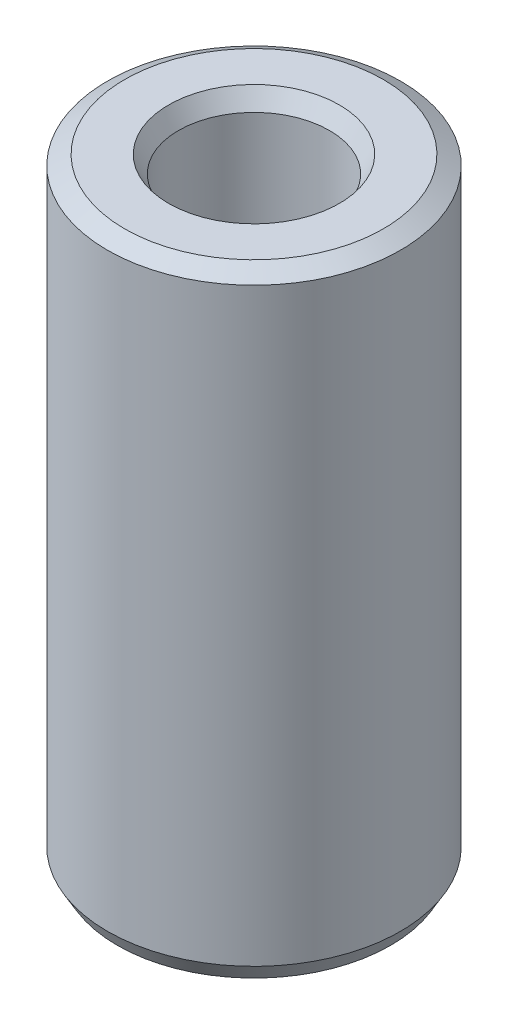
ISO-10303-21;
HEADER;
FILE_DESCRIPTION(('STEP AP214'),'2;1');
FILE_NAME('part.step','',(''),(''),'','','');
FILE_SCHEMA(('AUTOMOTIVE_DESIGN { 1 0 10303 214 1 1 1 1 }'));
ENDSEC;
DATA;
#1=APPLICATION_CONTEXT('core data for automotive mechanical design processes');
#2=APPLICATION_PROTOCOL_DEFINITION('international standard','automotive_design',2000,#1);
#3=PRODUCT_CONTEXT('',#1,'mechanical');
#4=PRODUCT('Part','Part','',(#3));
#5=PRODUCT_RELATED_PRODUCT_CATEGORY('part','',(#4));
#6=PRODUCT_DEFINITION_FORMATION('','',#4);
#7=PRODUCT_DEFINITION_CONTEXT('part definition',#1,'design');
#8=PRODUCT_DEFINITION('design','',#6,#7);
#9=PRODUCT_DEFINITION_SHAPE('','',#8);
#10=(LENGTH_UNIT() NAMED_UNIT(*) SI_UNIT(.MILLI.,.METRE.));
#11=(NAMED_UNIT(*) PLANE_ANGLE_UNIT() SI_UNIT($,.RADIAN.));
#12=(NAMED_UNIT(*) SI_UNIT($,.STERADIAN.) SOLID_ANGLE_UNIT());
#13=UNCERTAINTY_MEASURE_WITH_UNIT(LENGTH_MEASURE(1.E-05),#10,'distance_accuracy_value','');
#14=(GEOMETRIC_REPRESENTATION_CONTEXT(3) GLOBAL_UNCERTAINTY_ASSIGNED_CONTEXT((#13)) GLOBAL_UNIT_ASSIGNED_CONTEXT((#10,
#11,#12)) REPRESENTATION_CONTEXT('',''));
#15=CARTESIAN_POINT('',(0.,0.,0.));
#16=DIRECTION('',(0.,0.,1.));
#17=DIRECTION('',(1.,0.,0.));
#18=AXIS2_PLACEMENT_3D('',#15,#16,#17);
#19=CARTESIAN_POINT('',(0.,221.029050381448,0.));
#20=DIRECTION('',(0.,-1.,0.));
#21=DIRECTION('',(0.,0.,-1.));
#22=AXIS2_PLACEMENT_3D('',#19,#20,#21);
#23=CYLINDRICAL_SURFACE('',#22,52.5);
#24=CARTESIAN_POINT('',(0.,6.15118826672589,0.));
#25=DIRECTION('',(0.,1.,0.));
#26=DIRECTION('',(0.,0.,1.));
#27=AXIS2_PLACEMENT_3D('',#24,#25,#26);
#28=CIRCLE('',#27,52.5);
#29=CARTESIAN_POINT('',(0.,6.15118826672589,52.5));
#30=VERTEX_POINT('',#29);
#31=EDGE_CURVE('E10',#30,#30,#28,.T.);
#32=ORIENTED_EDGE('',*,*,#31,.T.);
#33=EDGE_LOOP('',(#32));
#34=FACE_BOUND('',#33,.T.);
#35=CARTESIAN_POINT('',(0.,217.477660179818,0.));
#36=DIRECTION('',(0.,1.,0.));
#37=DIRECTION('',(0.,0.,1.));
#38=AXIS2_PLACEMENT_3D('',#35,#36,#37);
#39=CIRCLE('',#38,52.5);
#40=CARTESIAN_POINT('',(0.,217.477660179818,52.5));
#41=VERTEX_POINT('',#40);
#42=EDGE_CURVE('E50',#41,#41,#39,.F.);
#43=ORIENTED_EDGE('',*,*,#42,.T.);
#44=EDGE_LOOP('',(#43));
#45=FACE_BOUND('',#44,.T.);
#46=ADVANCED_FACE('F39',(#34,#45),#23,.T.);
#47=CARTESIAN_POINT('',(0.,221.029050381448,0.));
#48=DIRECTION('',(0.,1.,0.));
#49=DIRECTION('',(0.,0.,1.));
#50=AXIS2_PLACEMENT_3D('',#47,#48,#49);
#51=PLANE('',#50);
#52=CARTESIAN_POINT('',(0.,221.029050381448,0.));
#53=DIRECTION('',(0.,1.,0.));
#54=DIRECTION('',(0.,0.,1.));
#55=AXIS2_PLACEMENT_3D('',#52,#53,#54);
#56=CIRCLE('',#55,30.5888498017471);
#57=CARTESIAN_POINT('',(0.,221.029050381448,30.5888498017471));
#58=VERTEX_POINT('',#57);
#59=EDGE_CURVE('E58',#58,#58,#56,.F.);
#60=ORIENTED_EDGE('',*,*,#59,.T.);
#61=EDGE_LOOP('',(#60));
#62=FACE_BOUND('',#61,.T.);
#63=CARTESIAN_POINT('',(0.,221.029050381448,0.));
#64=DIRECTION('',(0.,1.,0.));
#65=DIRECTION('',(0.,0.,1.));
#66=AXIS2_PLACEMENT_3D('',#63,#64,#65);
#67=CIRCLE('',#66,46.3488117332742);
#68=CARTESIAN_POINT('',(0.,221.029050381448,46.3488117332742));
#69=VERTEX_POINT('',#68);
#70=EDGE_CURVE('E61',#69,#69,#67,.T.);
#71=ORIENTED_EDGE('',*,*,#70,.T.);
#72=EDGE_LOOP('',(#71));
#73=FACE_BOUND('',#72,.T.);
#74=ADVANCED_FACE('F88',(#62,#73),#51,.T.);
#75=CARTESIAN_POINT('',(0.,0.,0.));
#76=DIRECTION('',(0.,1.,0.));
#77=DIRECTION('',(0.,0.,1.));
#78=AXIS2_PLACEMENT_3D('',#75,#76,#77);
#79=PLANE('',#78);
#80=CARTESIAN_POINT('',(0.,0.,0.));
#81=DIRECTION('',(0.,1.,0.));
#82=DIRECTION('',(0.,0.,1.));
#83=AXIS2_PLACEMENT_3D('',#80,#81,#82);
#84=CIRCLE('',#83,33.1886478668428);
#85=CARTESIAN_POINT('',(0.,0.,-33.1886478668428));
#86=VERTEX_POINT('',#85);
#87=EDGE_CURVE('E51',#86,#86,#84,.T.);
#88=ORIENTED_EDGE('',*,*,#87,.T.);
#89=EDGE_LOOP('',(#88));
#90=FACE_BOUND('',#89,.T.);
#91=CARTESIAN_POINT('',(0.,0.,0.));
#92=DIRECTION('',(0.,1.,0.));
#93=DIRECTION('',(0.,0.,1.));
#94=AXIS2_PLACEMENT_3D('',#91,#92,#93);
#95=CIRCLE('',#94,48.9486097983697);
#96=CARTESIAN_POINT('',(0.,0.,48.9486097983697));
#97=VERTEX_POINT('',#96);
#98=EDGE_CURVE('E54',#97,#97,#95,.F.);
#99=ORIENTED_EDGE('',*,*,#98,.T.);
#100=EDGE_LOOP('',(#99));
#101=FACE_BOUND('',#100,.T.);
#102=ADVANCED_FACE('F83',(#90,#101),#79,.F.);
#103=CARTESIAN_POINT('',(0.,221.029050381448,0.));
#104=DIRECTION('',(0.,-1.,0.));
#105=DIRECTION('',(0.,0.,-1.));
#106=AXIS2_PLACEMENT_3D('',#103,#104,#105);
#107=CYLINDRICAL_SURFACE('',#106,27.037459600117);
#108=CARTESIAN_POINT('',(0.,214.877862114723,0.));
#109=DIRECTION('',(0.,1.,0.));
#110=DIRECTION('',(0.,0.,1.));
#111=AXIS2_PLACEMENT_3D('',#108,#109,#110);
#112=CIRCLE('',#111,27.037459600117);
#113=CARTESIAN_POINT('',(0.,214.877862114723,27.037459600117));
#114=VERTEX_POINT('',#113);
#115=EDGE_CURVE('E67',#114,#114,#112,.T.);
#116=ORIENTED_EDGE('',*,*,#115,.T.);
#117=EDGE_LOOP('',(#116));
#118=FACE_BOUND('',#117,.T.);
#119=CARTESIAN_POINT('',(0.,3.55139020163028,0.));
#120=DIRECTION('',(0.,1.,0.));
#121=DIRECTION('',(0.,0.,1.));
#122=AXIS2_PLACEMENT_3D('',#119,#120,#121);
#123=CIRCLE('',#122,27.037459600117);
#124=CARTESIAN_POINT('',(0.,3.55139020163028,-27.037459600117));
#125=VERTEX_POINT('',#124);
#126=EDGE_CURVE('E69',#125,#125,#123,.F.);
#127=ORIENTED_EDGE('',*,*,#126,.T.);
#128=EDGE_LOOP('',(#127));
#129=FACE_BOUND('',#128,.T.);
#130=ADVANCED_FACE('F71',(#118,#129),#107,.F.);
#131=CARTESIAN_POINT('',(0.,214.877862114723,0.));
#132=DIRECTION('',(0.,1.,0.));
#133=DIRECTION('',(0.,0.,1.));
#134=AXIS2_PLACEMENT_3D('',#131,#132,#133);
#135=CONICAL_SURFACE('',#134,27.037459600117,0.523598775598298);
#136=ORIENTED_EDGE('',*,*,#59,.F.);
#137=EDGE_LOOP('',(#136));
#138=FACE_BOUND('',#137,.T.);
#139=ORIENTED_EDGE('',*,*,#115,.F.);
#140=EDGE_LOOP('',(#139));
#141=FACE_BOUND('',#140,.T.);
#142=ADVANCED_FACE('F77',(#138,#141),#135,.F.);
#143=CARTESIAN_POINT('',(0.,0.,0.));
#144=DIRECTION('',(0.,-1.,0.));
#145=DIRECTION('',(0.,0.,-1.));
#146=AXIS2_PLACEMENT_3D('',#143,#144,#145);
#147=CONICAL_SURFACE('',#146,33.1886478668428,1.04719755119659);
#148=CARTESIAN_POINT('',(0.,3.55139020163028,-27.037459600117));
#149=CARTESIAN_POINT('',(0.,3.51439655369663,-27.1015344778954));
#150=CARTESIAN_POINT('',(0.,3.47740290576299,-27.1656093556738));
#151=CARTESIAN_POINT('',(0.,3.40341560989569,-27.2937591112305));
#152=CARTESIAN_POINT('',(0.,3.36642196196204,-27.3578339890089));
#153=CARTESIAN_POINT('',(0.,3.29243466609474,-27.4859837445657));
#154=CARTESIAN_POINT('',(0.,3.25544101816109,-27.5500586223441));
#155=CARTESIAN_POINT('',(0.,3.18145372229379,-27.6782083779009));
#156=CARTESIAN_POINT('',(0.,3.14446007436015,-27.7422832556793));
#157=CARTESIAN_POINT('',(0.,3.07047277849285,-27.8704330112361));
#158=CARTESIAN_POINT('',(0.,3.0334791305592,-27.9345078890145));
#159=CARTESIAN_POINT('',(0.,2.9594918346919,-28.0626576445713));
#160=CARTESIAN_POINT('',(0.,2.92249818675825,-28.1267325223497));
#161=CARTESIAN_POINT('',(0.,2.84851089089096,-28.2548822779065));
#162=CARTESIAN_POINT('',(0.,2.81151724295731,-28.3189571556849));
#163=CARTESIAN_POINT('',(0.,2.73752994709001,-28.4471069112416));
#164=CARTESIAN_POINT('',(0.,2.70053629915636,-28.51118178902));
#165=CARTESIAN_POINT('',(0.,2.62654900328906,-28.6393315445768));
#166=CARTESIAN_POINT('',(0.,2.58955535535541,-28.7034064223552));
#167=CARTESIAN_POINT('',(0.,2.51556805948812,-28.831556177912));
#168=CARTESIAN_POINT('',(0.,2.47857441155447,-28.8956310556904));
#169=CARTESIAN_POINT('',(0.,2.40458711568717,-29.0237808112472));
#170=CARTESIAN_POINT('',(0.,2.36759346775352,-29.0878556890256));
#171=CARTESIAN_POINT('',(0.,2.29360617188622,-29.2160054445824));
#172=CARTESIAN_POINT('',(0.,2.25661252395258,-29.2800803223608));
#173=CARTESIAN_POINT('',(0.,2.18262522808528,-29.4082300779176));
#174=CARTESIAN_POINT('',(0.,2.14563158015163,-29.472304955696));
#175=CARTESIAN_POINT('',(0.,2.07164428428433,-29.6004547112527));
#176=CARTESIAN_POINT('',(0.,2.03465063635068,-29.6645295890311));
#177=CARTESIAN_POINT('',(0.,1.96066334048339,-29.7926793445879));
#178=CARTESIAN_POINT('',(0.,1.92366969254974,-29.8567542223663));
#179=CARTESIAN_POINT('',(0.,1.84968239668244,-29.9849039779231));
#180=CARTESIAN_POINT('',(0.,1.81268874874879,-30.0489788557015));
#181=CARTESIAN_POINT('',(0.,1.73870145288149,-30.1771286112583));
#182=CARTESIAN_POINT('',(0.,1.70170780494784,-30.2412034890367));
#183=CARTESIAN_POINT('',(0.,1.62772050908055,-30.3693532445935));
#184=CARTESIAN_POINT('',(0.,1.5907268611469,-30.4334281223719));
#185=CARTESIAN_POINT('',(0.,1.5167395652796,-30.5615778779287));
#186=CARTESIAN_POINT('',(0.,1.47974591734595,-30.6256527557071));
#187=CARTESIAN_POINT('',(0.,1.40575862147865,-30.7538025112638));
#188=CARTESIAN_POINT('',(0.,1.36876497354501,-30.8178773890422));
#189=CARTESIAN_POINT('',(0.,1.29477767767771,-30.946027144599));
#190=CARTESIAN_POINT('',(0.,1.25778402974406,-31.0101020223774));
#191=CARTESIAN_POINT('',(0.,1.18379673387676,-31.1382517779342));
#192=CARTESIAN_POINT('',(0.,1.14680308594311,-31.2023266557126));
#193=CARTESIAN_POINT('',(0.,1.07281579007581,-31.3304764112694));
#194=CARTESIAN_POINT('',(0.,1.03582214214217,-31.3945512890478));
#195=CARTESIAN_POINT('',(0.,0.961834846274868,-31.5227010446046));
#196=CARTESIAN_POINT('',(0.,0.92484119834122,-31.586775922383));
#197=CARTESIAN_POINT('',(0.,0.850853902473922,-31.7149256779398));
#198=CARTESIAN_POINT('',(0.,0.813860254540273,-31.7790005557182));
#199=CARTESIAN_POINT('',(0.,0.739872958672975,-31.9071503112749));
#200=CARTESIAN_POINT('',(0.,0.702879310739327,-31.9712251890533));
#201=CARTESIAN_POINT('',(0.,0.62889201487203,-32.0993749446101));
#202=CARTESIAN_POINT('',(0.,0.591898366938381,-32.1634498223885));
#203=CARTESIAN_POINT('',(0.,0.517911071071082,-32.2915995779453));
#204=CARTESIAN_POINT('',(0.,0.480917423137433,-32.3556744557237));
#205=CARTESIAN_POINT('',(0.,0.406930127270136,-32.4838242112805));
#206=CARTESIAN_POINT('',(0.,0.369936479336488,-32.5478990890589));
#207=CARTESIAN_POINT('',(0.,0.295949183469191,-32.6760488446157));
#208=CARTESIAN_POINT('',(0.,0.258955535535541,-32.7401237223941));
#209=CARTESIAN_POINT('',(0.,0.184968239668243,-32.8682734779509));
#210=CARTESIAN_POINT('',(0.,0.147974591734595,-32.9323483557293));
#211=CARTESIAN_POINT('',(0.,0.0739872958672987,-33.0604981112861));
#212=CARTESIAN_POINT('',(0.,0.0369936479336505,-33.1245729890644));
#213=CARTESIAN_POINT('',(0.,0.,-33.1886478668428));
#214=B_SPLINE_CURVE_WITH_KNOTS('',3,(#148,#149,#150,#151,#152,#153,#154,#155,#156,#157,#158,
#159,#160,#161,#162,#163,#164,#165,#166,#167,#168,#169,#170,#171,#172,#173,#174,#175,#176,#177,
#178,#179,#180,#181,#182,#183,#184,#185,#186,#187,#188,#189,#190,#191,#192,#193,#194,#195,#196,
#197,#198,#199,#200,#201,#202,#203,#204,#205,#206,#207,#208,#209,#210,#211,#212,#213),
.UNSPECIFIED.,.F.,.F.,(4,2,2,2,2,2,2,2,2,2,2,2,2,2,2,2,2,2,2,2,2,2,2,2,2,2,2,2,2,2,2,2,4),(0.,
0.221961887601892,0.44392377520378,0.665885662805672,0.887847550407564,1.10980943800946,
1.33177132561135,1.55373321321324,1.77569510081513,1.99765698841702,2.21961887601891,
2.4415807636208,2.66354265122269,2.88550453882458,3.10746642642648,3.32942831402837,
3.55139020163026,3.77335208923215,3.99531397683404,4.21727586443593,4.43923775203782,
4.66119963963971,4.8831615272416,5.10512341484349,5.32708530244539,5.54904719004727,
5.77100907764917,5.99297096525106,6.21493285285295,6.43689474045484,6.65885662805673,
6.88081851565862,7.10278040326051),.UNSPECIFIED.);
#215=EDGE_CURVE('BSEAM73',#125,#86,#214,.T.);
#216=ORIENTED_EDGE('',*,*,#126,.F.);
#217=ORIENTED_EDGE('',*,*,#87,.F.);
#218=ORIENTED_EDGE('',*,*,#215,.T.);
#219=ORIENTED_EDGE('',*,*,#215,.F.);
#220=EDGE_LOOP('',(#216,#218,#217,#219));
#221=FACE_BOUND('',#220,.T.);
#222=ADVANCED_FACE('F73',(#221),#147,.F.);
#223=CARTESIAN_POINT('',(0.,6.15118826672589,0.));
#224=DIRECTION('',(0.,1.,0.));
#225=DIRECTION('',(0.,0.,1.));
#226=AXIS2_PLACEMENT_3D('',#223,#224,#225);
#227=CONICAL_SURFACE('',#226,52.5,0.523598775598301);
#228=ORIENTED_EDGE('',*,*,#98,.F.);
#229=EDGE_LOOP('',(#228));
#230=FACE_BOUND('',#229,.T.);
#231=ORIENTED_EDGE('',*,*,#31,.F.);
#232=EDGE_LOOP('',(#231));
#233=FACE_BOUND('',#232,.T.);
#234=ADVANCED_FACE('F76',(#230,#233),#227,.T.);
#235=CARTESIAN_POINT('',(0.,221.029050381448,0.));
#236=DIRECTION('',(0.,-1.,0.));
#237=DIRECTION('',(0.,0.,-1.));
#238=AXIS2_PLACEMENT_3D('',#235,#236,#237);
#239=CONICAL_SURFACE('',#238,46.3488117332742,1.04719755119659);
#240=ORIENTED_EDGE('',*,*,#42,.F.);
#241=EDGE_LOOP('',(#240));
#242=FACE_BOUND('',#241,.T.);
#243=ORIENTED_EDGE('',*,*,#70,.F.);
#244=EDGE_LOOP('',(#243));
#245=FACE_BOUND('',#244,.T.);
#246=ADVANCED_FACE('F45',(#242,#245),#239,.T.);
#247=CLOSED_SHELL('',(#46,#74,#102,#130,#142,#222,#234,#246));
#248=MANIFOLD_SOLID_BREP('B2',#247);
#249=ADVANCED_BREP_SHAPE_REPRESENTATION('',(#18,#248),#14);
#250=SHAPE_DEFINITION_REPRESENTATION(#9,#249);
ENDSEC;
END-ISO-10303-21;
